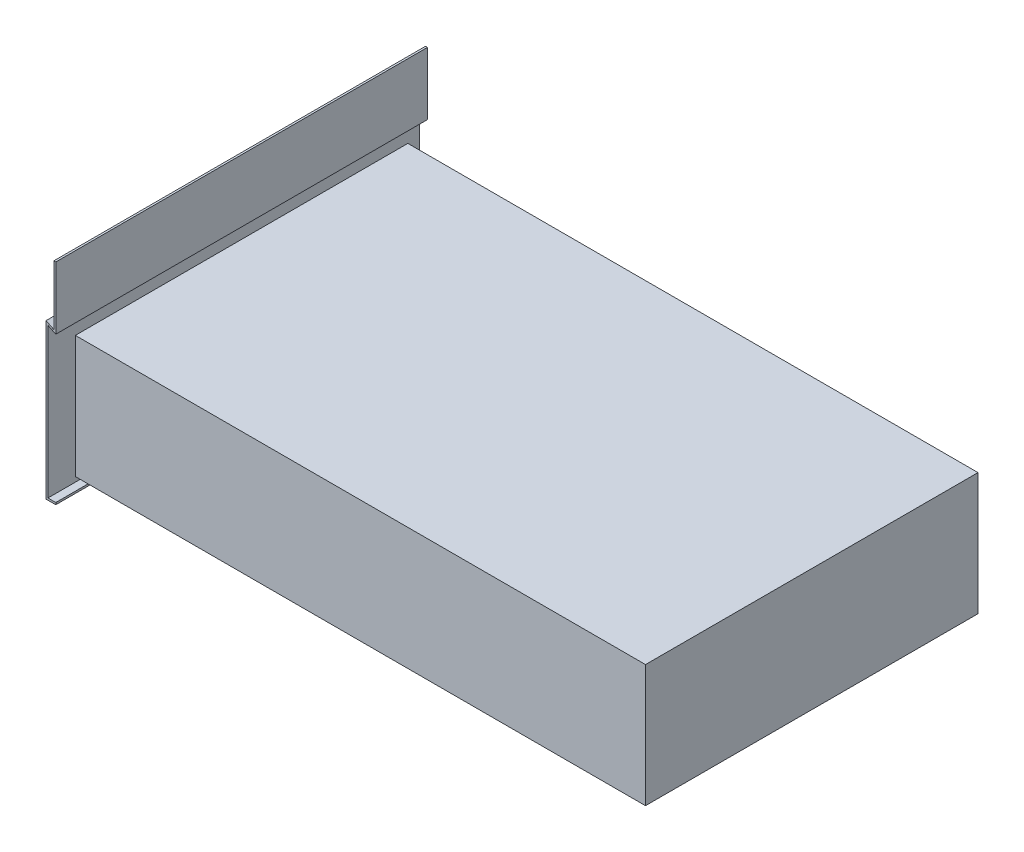
ISO-10303-21;
HEADER;
FILE_DESCRIPTION(('STEP AP214'),'2;1');
FILE_NAME('part.step','',(''),(''),'','','');
FILE_SCHEMA(('AUTOMOTIVE_DESIGN { 1 0 10303 214 1 1 1 1 }'));
ENDSEC;
DATA;
#1=APPLICATION_CONTEXT('core data for automotive mechanical design processes');
#2=APPLICATION_PROTOCOL_DEFINITION('international standard','automotive_design',2000,#1);
#3=PRODUCT_CONTEXT('',#1,'mechanical');
#4=PRODUCT('Part','Part','',(#3));
#5=PRODUCT_RELATED_PRODUCT_CATEGORY('part','',(#4));
#6=PRODUCT_DEFINITION_FORMATION('','',#4);
#7=PRODUCT_DEFINITION_CONTEXT('part definition',#1,'design');
#8=PRODUCT_DEFINITION('design','',#6,#7);
#9=PRODUCT_DEFINITION_SHAPE('','',#8);
#10=(LENGTH_UNIT() NAMED_UNIT(*) SI_UNIT(.MILLI.,.METRE.));
#11=(NAMED_UNIT(*) PLANE_ANGLE_UNIT() SI_UNIT($,.RADIAN.));
#12=(NAMED_UNIT(*) SI_UNIT($,.STERADIAN.) SOLID_ANGLE_UNIT());
#13=UNCERTAINTY_MEASURE_WITH_UNIT(LENGTH_MEASURE(1.E-05),#10,'distance_accuracy_value','');
#14=(GEOMETRIC_REPRESENTATION_CONTEXT(3) GLOBAL_UNCERTAINTY_ASSIGNED_CONTEXT((#13)) GLOBAL_UNIT_ASSIGNED_CONTEXT((#10,
#11,#12)) REPRESENTATION_CONTEXT('',''));
#15=CARTESIAN_POINT('',(0.,0.,0.));
#16=DIRECTION('',(0.,0.,1.));
#17=DIRECTION('',(1.,0.,0.));
#18=AXIS2_PLACEMENT_3D('',#15,#16,#17);
#19=CARTESIAN_POINT('',(0.,139.221174377272,-190.));
#20=DIRECTION('',(1.,0.,0.));
#21=DIRECTION('',(0.,0.,-1.));
#22=AXIS2_PLACEMENT_3D('',#19,#20,#21);
#23=PLANE('',#22);
#24=DIRECTION('',(0.,0.,1.));
#25=VECTOR('',#24,1.);
#26=CARTESIAN_POINT('',(0.,200.,-190.));
#27=LINE('',#26,#25);
#28=CARTESIAN_POINT('',(0.,200.,-190.));
#29=VERTEX_POINT('',#28);
#30=CARTESIAN_POINT('',(0.,200.,190.));
#31=VERTEX_POINT('',#30);
#32=EDGE_CURVE('E47',#29,#31,#27,.T.);
#33=ORIENTED_EDGE('',*,*,#32,.T.);
#34=DIRECTION('',(0.,1.,0.));
#35=VECTOR('',#34,1.);
#36=CARTESIAN_POINT('',(0.,139.221174377272,190.));
#37=LINE('',#36,#35);
#38=CARTESIAN_POINT('',(0.,136.043424311535,190.));
#39=VERTEX_POINT('',#38);
#40=EDGE_CURVE('E120',#39,#31,#37,.T.);
#41=ORIENTED_EDGE('',*,*,#40,.F.);
#42=DIRECTION('',(0.,0.,1.));
#43=VECTOR('',#42,1.);
#44=CARTESIAN_POINT('',(0.,136.043424311535,-190.));
#45=LINE('',#44,#43);
#46=CARTESIAN_POINT('',(0.,136.043424311535,-190.));
#47=VERTEX_POINT('',#46);
#48=EDGE_CURVE('E12',#47,#39,#45,.T.);
#49=ORIENTED_EDGE('',*,*,#48,.F.);
#50=DIRECTION('',(0.,1.,0.));
#51=VECTOR('',#50,1.);
#52=CARTESIAN_POINT('',(0.,139.221174377272,-190.));
#53=LINE('',#52,#51);
#54=EDGE_CURVE('E121',#47,#29,#53,.T.);
#55=ORIENTED_EDGE('',*,*,#54,.T.);
#56=EDGE_LOOP('',(#33,#41,#49,#55));
#57=FACE_BOUND('',#56,.T.);
#58=ADVANCED_FACE('F44',(#57),#23,.T.);
#59=CARTESIAN_POINT('',(-10.8650949326902,141.25594771106,-190.));
#60=DIRECTION('',(-0.432547466345104,-0.901611163062232,0.));
#61=DIRECTION('',(0.901611163062232,-0.432547466345104,0.));
#62=AXIS2_PLACEMENT_3D('',#59,#60,#61);
#63=PLANE('',#62);
#64=ORIENTED_EDGE('',*,*,#48,.T.);
#65=DIRECTION('',(0.901611163062232,-0.432547466345104,0.));
#66=VECTOR('',#65,1.);
#67=CARTESIAN_POINT('',(-10.8650949326902,141.25594771106,190.));
#68=LINE('',#67,#66);
#69=CARTESIAN_POINT('',(-8.,139.881419971447,190.));
#70=VERTEX_POINT('',#69);
#71=EDGE_CURVE('E135',#70,#39,#68,.T.);
#72=ORIENTED_EDGE('',*,*,#71,.F.);
#73=DIRECTION('',(0.,0.,1.));
#74=VECTOR('',#73,1.);
#75=CARTESIAN_POINT('',(-8.,139.881419971447,-190.));
#76=LINE('',#75,#74);
#77=CARTESIAN_POINT('',(-8.,139.881419971447,-190.));
#78=VERTEX_POINT('',#77);
#79=EDGE_CURVE('E52',#78,#70,#76,.T.);
#80=ORIENTED_EDGE('',*,*,#79,.F.);
#81=DIRECTION('',(0.901611163062232,-0.432547466345104,0.));
#82=VECTOR('',#81,1.);
#83=CARTESIAN_POINT('',(-10.8650949326902,141.25594771106,-190.));
#84=LINE('',#83,#82);
#85=EDGE_CURVE('E126',#78,#47,#84,.T.);
#86=ORIENTED_EDGE('',*,*,#85,.T.);
#87=EDGE_LOOP('',(#64,#72,#80,#86));
#88=FACE_BOUND('',#87,.T.);
#89=ADVANCED_FACE('F225',(#88),#63,.T.);
#90=CARTESIAN_POINT('',(-8.,-15.,-190.));
#91=DIRECTION('',(1.,0.,0.));
#92=DIRECTION('',(0.,0.,-1.));
#93=AXIS2_PLACEMENT_3D('',#90,#91,#92);
#94=PLANE('',#93);
#95=ORIENTED_EDGE('',*,*,#79,.T.);
#96=DIRECTION('',(0.,1.,0.));
#97=VECTOR('',#96,1.);
#98=CARTESIAN_POINT('',(-8.,-15.,190.));
#99=LINE('',#98,#97);
#100=CARTESIAN_POINT('',(-8.,-13.,190.));
#101=VERTEX_POINT('',#100);
#102=EDGE_CURVE('E158',#101,#70,#99,.T.);
#103=ORIENTED_EDGE('',*,*,#102,.F.);
#104=DIRECTION('',(0.,0.,1.));
#105=VECTOR('',#104,1.);
#106=CARTESIAN_POINT('',(-8.,-13.,-190.));
#107=LINE('',#106,#105);
#108=CARTESIAN_POINT('',(-8.,-13.,-190.));
#109=VERTEX_POINT('',#108);
#110=EDGE_CURVE('E181',#109,#101,#107,.T.);
#111=ORIENTED_EDGE('',*,*,#110,.F.);
#112=DIRECTION('',(0.,1.,0.));
#113=VECTOR('',#112,1.);
#114=CARTESIAN_POINT('',(-8.,-15.,-190.));
#115=LINE('',#114,#113);
#116=EDGE_CURVE('E177',#109,#78,#115,.T.);
#117=ORIENTED_EDGE('',*,*,#116,.T.);
#118=EDGE_LOOP('',(#95,#103,#111,#117));
#119=FACE_BOUND('',#118,.T.);
#120=ADVANCED_FACE('F220',(#119),#94,.T.);
#121=CARTESIAN_POINT('',(0.,-13.,-190.));
#122=DIRECTION('',(0.,1.,0.));
#123=DIRECTION('',(-1.,0.,0.));
#124=AXIS2_PLACEMENT_3D('',#121,#122,#123);
#125=PLANE('',#124);
#126=ORIENTED_EDGE('',*,*,#110,.T.);
#127=DIRECTION('',(-1.,0.,0.));
#128=VECTOR('',#127,1.);
#129=CARTESIAN_POINT('',(0.,-13.,190.));
#130=LINE('',#129,#128);
#131=CARTESIAN_POINT('',(0.,-13.,190.));
#132=VERTEX_POINT('',#131);
#133=EDGE_CURVE('E155',#132,#101,#130,.T.);
#134=ORIENTED_EDGE('',*,*,#133,.F.);
#135=DIRECTION('',(0.,0.,1.));
#136=VECTOR('',#135,1.);
#137=CARTESIAN_POINT('',(0.,-13.,-190.));
#138=LINE('',#137,#136);
#139=CARTESIAN_POINT('',(0.,-13.,-190.));
#140=VERTEX_POINT('',#139);
#141=EDGE_CURVE('E183',#140,#132,#138,.T.);
#142=ORIENTED_EDGE('',*,*,#141,.F.);
#143=DIRECTION('',(-1.,0.,0.));
#144=VECTOR('',#143,1.);
#145=CARTESIAN_POINT('',(0.,-13.,-190.));
#146=LINE('',#145,#144);
#147=EDGE_CURVE('E174',#140,#109,#146,.T.);
#148=ORIENTED_EDGE('',*,*,#147,.T.);
#149=EDGE_LOOP('',(#126,#134,#142,#148));
#150=FACE_BOUND('',#149,.T.);
#151=ADVANCED_FACE('F232',(#150),#125,.T.);
#152=CARTESIAN_POINT('',(0.,-13.,-190.));
#153=DIRECTION('',(-1.,0.,0.));
#154=DIRECTION('',(0.,-1.,0.));
#155=AXIS2_PLACEMENT_3D('',#152,#153,#154);
#156=PLANE('',#155);
#157=ORIENTED_EDGE('',*,*,#141,.T.);
#158=DIRECTION('',(0.,-1.,0.));
#159=VECTOR('',#158,1.);
#160=CARTESIAN_POINT('',(0.,-13.,190.));
#161=LINE('',#160,#159);
#162=CARTESIAN_POINT('',(0.,-15.,190.));
#163=VERTEX_POINT('',#162);
#164=EDGE_CURVE('E152',#132,#163,#161,.T.);
#165=ORIENTED_EDGE('',*,*,#164,.T.);
#166=DIRECTION('',(0.,0.,1.));
#167=VECTOR('',#166,1.);
#168=CARTESIAN_POINT('',(0.,-15.,-190.));
#169=LINE('',#168,#167);
#170=CARTESIAN_POINT('',(0.,-15.,-190.));
#171=VERTEX_POINT('',#170);
#172=EDGE_CURVE('E185',#171,#163,#169,.T.);
#173=ORIENTED_EDGE('',*,*,#172,.F.);
#174=DIRECTION('',(0.,-1.,0.));
#175=VECTOR('',#174,1.);
#176=CARTESIAN_POINT('',(0.,-13.,-190.));
#177=LINE('',#176,#175);
#178=EDGE_CURVE('E172',#140,#171,#177,.T.);
#179=ORIENTED_EDGE('',*,*,#178,.F.);
#180=EDGE_LOOP('',(#157,#165,#173,#179));
#181=FACE_BOUND('',#180,.T.);
#182=ADVANCED_FACE('F214',(#181),#156,.F.);
#183=CARTESIAN_POINT('',(0.,-15.,-190.));
#184=DIRECTION('',(0.,1.,0.));
#185=DIRECTION('',(-1.,0.,0.));
#186=AXIS2_PLACEMENT_3D('',#183,#184,#185);
#187=PLANE('',#186);
#188=ORIENTED_EDGE('',*,*,#172,.T.);
#189=DIRECTION('',(-1.,0.,0.));
#190=VECTOR('',#189,1.);
#191=CARTESIAN_POINT('',(0.,-15.,190.));
#192=LINE('',#191,#190);
#193=CARTESIAN_POINT('',(-10.,-15.,190.));
#194=VERTEX_POINT('',#193);
#195=EDGE_CURVE('E149',#163,#194,#192,.T.);
#196=ORIENTED_EDGE('',*,*,#195,.T.);
#197=DIRECTION('',(0.,0.,1.));
#198=VECTOR('',#197,1.);
#199=CARTESIAN_POINT('',(-10.,-15.,-190.));
#200=LINE('',#199,#198);
#201=CARTESIAN_POINT('',(-10.,-15.,-190.));
#202=VERTEX_POINT('',#201);
#203=EDGE_CURVE('E187',#202,#194,#200,.T.);
#204=ORIENTED_EDGE('',*,*,#203,.F.);
#205=DIRECTION('',(-1.,0.,0.));
#206=VECTOR('',#205,1.);
#207=CARTESIAN_POINT('',(0.,-15.,-190.));
#208=LINE('',#207,#206);
#209=EDGE_CURVE('E170',#171,#202,#208,.T.);
#210=ORIENTED_EDGE('',*,*,#209,.F.);
#211=EDGE_LOOP('',(#188,#196,#204,#210));
#212=FACE_BOUND('',#211,.T.);
#213=ADVANCED_FACE('F209',(#212),#187,.F.);
#214=CARTESIAN_POINT('',(-10.,-15.,-190.));
#215=DIRECTION('',(1.,0.,0.));
#216=DIRECTION('',(0.,0.,-1.));
#217=AXIS2_PLACEMENT_3D('',#214,#215,#216);
#218=PLANE('',#217);
#219=ORIENTED_EDGE('',*,*,#203,.T.);
#220=DIRECTION('',(0.,1.,0.));
#221=VECTOR('',#220,1.);
#222=CARTESIAN_POINT('',(-10.,-15.,190.));
#223=LINE('',#222,#221);
#224=CARTESIAN_POINT('',(-10.,143.059170037184,190.));
#225=VERTEX_POINT('',#224);
#226=EDGE_CURVE('E146',#194,#225,#223,.T.);
#227=ORIENTED_EDGE('',*,*,#226,.T.);
#228=DIRECTION('',(0.,0.,1.));
#229=VECTOR('',#228,1.);
#230=CARTESIAN_POINT('',(-10.,143.059170037184,-190.));
#231=LINE('',#230,#229);
#232=CARTESIAN_POINT('',(-10.,143.059170037184,-190.));
#233=VERTEX_POINT('',#232);
#234=EDGE_CURVE('E189',#233,#225,#231,.T.);
#235=ORIENTED_EDGE('',*,*,#234,.F.);
#236=DIRECTION('',(0.,1.,0.));
#237=VECTOR('',#236,1.);
#238=CARTESIAN_POINT('',(-10.,-15.,-190.));
#239=LINE('',#238,#237);
#240=EDGE_CURVE('E168',#202,#233,#239,.T.);
#241=ORIENTED_EDGE('',*,*,#240,.F.);
#242=EDGE_LOOP('',(#219,#227,#235,#241));
#243=FACE_BOUND('',#242,.T.);
#244=ADVANCED_FACE('F204',(#243),#218,.F.);
#245=CARTESIAN_POINT('',(-10.,143.059170037184,-190.));
#246=DIRECTION('',(-0.432547466345104,-0.901611163062232,0.));
#247=DIRECTION('',(0.901611163062232,-0.432547466345104,0.));
#248=AXIS2_PLACEMENT_3D('',#245,#246,#247);
#249=PLANE('',#248);
#250=ORIENTED_EDGE('',*,*,#234,.T.);
#251=DIRECTION('',(0.901611163062232,-0.432547466345104,0.));
#252=VECTOR('',#251,1.);
#253=CARTESIAN_POINT('',(-10.,143.059170037184,190.));
#254=LINE('',#253,#252);
#255=CARTESIAN_POINT('',(-2.,139.221174377272,190.));
#256=VERTEX_POINT('',#255);
#257=EDGE_CURVE('E141',#225,#256,#254,.T.);
#258=ORIENTED_EDGE('',*,*,#257,.T.);
#259=DIRECTION('',(0.,0.,1.));
#260=VECTOR('',#259,1.);
#261=CARTESIAN_POINT('',(-2.,139.221174377272,-190.));
#262=LINE('',#261,#260);
#263=CARTESIAN_POINT('',(-2.,139.221174377272,-190.));
#264=VERTEX_POINT('',#263);
#265=EDGE_CURVE('E191',#264,#256,#262,.T.);
#266=ORIENTED_EDGE('',*,*,#265,.F.);
#267=DIRECTION('',(0.901611163062232,-0.432547466345104,0.));
#268=VECTOR('',#267,1.);
#269=CARTESIAN_POINT('',(-10.,143.059170037184,-190.));
#270=LINE('',#269,#268);
#271=EDGE_CURVE('E166',#233,#264,#270,.T.);
#272=ORIENTED_EDGE('',*,*,#271,.F.);
#273=EDGE_LOOP('',(#250,#258,#266,#272));
#274=FACE_BOUND('',#273,.T.);
#275=ADVANCED_FACE('F200',(#274),#249,.F.);
#276=CARTESIAN_POINT('',(-2.,139.221174377272,-190.));
#277=DIRECTION('',(1.,0.,0.));
#278=DIRECTION('',(0.,0.,-1.));
#279=AXIS2_PLACEMENT_3D('',#276,#277,#278);
#280=PLANE('',#279);
#281=ORIENTED_EDGE('',*,*,#265,.T.);
#282=DIRECTION('',(0.,1.,0.));
#283=VECTOR('',#282,1.);
#284=CARTESIAN_POINT('',(-2.,139.221174377272,190.));
#285=LINE('',#284,#283);
#286=CARTESIAN_POINT('',(-2.,200.,190.));
#287=VERTEX_POINT('',#286);
#288=EDGE_CURVE('E139',#256,#287,#285,.T.);
#289=ORIENTED_EDGE('',*,*,#288,.T.);
#290=DIRECTION('',(0.,0.,1.));
#291=VECTOR('',#290,1.);
#292=CARTESIAN_POINT('',(-2.,200.,-190.));
#293=LINE('',#292,#291);
#294=CARTESIAN_POINT('',(-2.,200.,-190.));
#295=VERTEX_POINT('',#294);
#296=EDGE_CURVE('E125',#295,#287,#293,.T.);
#297=ORIENTED_EDGE('',*,*,#296,.F.);
#298=DIRECTION('',(0.,1.,0.));
#299=VECTOR('',#298,1.);
#300=CARTESIAN_POINT('',(-2.,139.221174377272,-190.));
#301=LINE('',#300,#299);
#302=EDGE_CURVE('E164',#264,#295,#301,.T.);
#303=ORIENTED_EDGE('',*,*,#302,.F.);
#304=EDGE_LOOP('',(#281,#289,#297,#303));
#305=FACE_BOUND('',#304,.T.);
#306=ADVANCED_FACE('F195',(#305),#280,.F.);
#307=CARTESIAN_POINT('',(-2.,200.,-190.));
#308=DIRECTION('',(0.,-1.,0.));
#309=DIRECTION('',(0.,0.,-1.));
#310=AXIS2_PLACEMENT_3D('',#307,#308,#309);
#311=PLANE('',#310);
#312=ORIENTED_EDGE('',*,*,#296,.T.);
#313=DIRECTION('',(1.,0.,0.));
#314=VECTOR('',#313,1.);
#315=CARTESIAN_POINT('',(-2.,200.,190.));
#316=LINE('',#315,#314);
#317=EDGE_CURVE('E132',#287,#31,#316,.T.);
#318=ORIENTED_EDGE('',*,*,#317,.T.);
#319=ORIENTED_EDGE('',*,*,#32,.F.);
#320=DIRECTION('',(1.,0.,0.));
#321=VECTOR('',#320,1.);
#322=CARTESIAN_POINT('',(-2.,200.,-190.));
#323=LINE('',#322,#321);
#324=EDGE_CURVE('E162',#295,#29,#323,.T.);
#325=ORIENTED_EDGE('',*,*,#324,.F.);
#326=EDGE_LOOP('',(#312,#318,#319,#325));
#327=FACE_BOUND('',#326,.T.);
#328=ADVANCED_FACE('F137',(#327),#311,.F.);
#329=CARTESIAN_POINT('',(0.,0.,-190.));
#330=DIRECTION('',(0.,0.,-1.));
#331=DIRECTION('',(-1.,0.,0.));
#332=AXIS2_PLACEMENT_3D('',#329,#330,#331);
#333=PLANE('',#332);
#334=ORIENTED_EDGE('',*,*,#54,.F.);
#335=ORIENTED_EDGE('',*,*,#85,.F.);
#336=ORIENTED_EDGE('',*,*,#116,.F.);
#337=ORIENTED_EDGE('',*,*,#147,.F.);
#338=ORIENTED_EDGE('',*,*,#178,.T.);
#339=ORIENTED_EDGE('',*,*,#209,.T.);
#340=ORIENTED_EDGE('',*,*,#240,.T.);
#341=ORIENTED_EDGE('',*,*,#271,.T.);
#342=ORIENTED_EDGE('',*,*,#302,.T.);
#343=ORIENTED_EDGE('',*,*,#324,.T.);
#344=EDGE_LOOP('',(#334,#335,#336,#337,#338,#339,#340,#341,#342,#343));
#345=FACE_BOUND('',#344,.T.);
#346=ADVANCED_FACE('F224',(#345),#333,.T.);
#347=CARTESIAN_POINT('',(0.,0.,190.));
#348=DIRECTION('',(0.,0.,-1.));
#349=DIRECTION('',(-1.,0.,0.));
#350=AXIS2_PLACEMENT_3D('',#347,#348,#349);
#351=PLANE('',#350);
#352=ORIENTED_EDGE('',*,*,#40,.T.);
#353=ORIENTED_EDGE('',*,*,#317,.F.);
#354=ORIENTED_EDGE('',*,*,#288,.F.);
#355=ORIENTED_EDGE('',*,*,#257,.F.);
#356=ORIENTED_EDGE('',*,*,#226,.F.);
#357=ORIENTED_EDGE('',*,*,#195,.F.);
#358=ORIENTED_EDGE('',*,*,#164,.F.);
#359=ORIENTED_EDGE('',*,*,#133,.T.);
#360=ORIENTED_EDGE('',*,*,#102,.T.);
#361=ORIENTED_EDGE('',*,*,#71,.T.);
#362=EDGE_LOOP('',(#352,#353,#354,#355,#356,#357,#358,#359,#360,#361));
#363=FACE_BOUND('',#362,.T.);
#364=ADVANCED_FACE('F130',(#363),#351,.F.);
#365=CLOSED_SHELL('',(#58,#89,#120,#151,#182,#213,#244,#275,#306,#328,#346,#364));
#366=MANIFOLD_SOLID_BREP('B2',#365);
#367=CARTESIAN_POINT('',(0.,125.,170.));
#368=DIRECTION('',(1.,0.,0.));
#369=DIRECTION('',(0.,0.,-1.));
#370=AXIS2_PLACEMENT_3D('',#367,#368,#369);
#371=PLANE('',#370);
#372=DIRECTION('',(0.,0.,1.));
#373=VECTOR('',#372,1.);
#374=CARTESIAN_POINT('',(0.,0.,170.));
#375=LINE('',#374,#373);
#376=CARTESIAN_POINT('',(0.,0.,-170.));
#377=VERTEX_POINT('',#376);
#378=CARTESIAN_POINT('',(0.,0.,170.));
#379=VERTEX_POINT('',#378);
#380=EDGE_CURVE('E422',#377,#379,#375,.T.);
#381=ORIENTED_EDGE('',*,*,#380,.T.);
#382=DIRECTION('',(0.,-1.,0.));
#383=VECTOR('',#382,1.);
#384=CARTESIAN_POINT('',(0.,125.,170.));
#385=LINE('',#384,#383);
#386=CARTESIAN_POINT('',(0.,125.,170.));
#387=VERTEX_POINT('',#386);
#388=EDGE_CURVE('E42',#387,#379,#385,.T.);
#389=ORIENTED_EDGE('',*,*,#388,.F.);
#390=DIRECTION('',(0.,0.,1.));
#391=VECTOR('',#390,1.);
#392=CARTESIAN_POINT('',(0.,125.,170.));
#393=LINE('',#392,#391);
#394=CARTESIAN_POINT('',(0.,125.,-170.));
#395=VERTEX_POINT('',#394);
#396=EDGE_CURVE('E432',#395,#387,#393,.T.);
#397=ORIENTED_EDGE('',*,*,#396,.F.);
#398=DIRECTION('',(0.,-1.,0.));
#399=VECTOR('',#398,1.);
#400=CARTESIAN_POINT('',(0.,125.,-170.));
#401=LINE('',#400,#399);
#402=EDGE_CURVE('E437',#395,#377,#401,.T.);
#403=ORIENTED_EDGE('',*,*,#402,.T.);
#404=EDGE_LOOP('',(#381,#389,#397,#403));
#405=FACE_BOUND('',#404,.T.);
#406=ADVANCED_FACE('F324',(#405),#371,.F.);
#407=CARTESIAN_POINT('',(0.,125.,170.));
#408=DIRECTION('',(0.,0.,-1.));
#409=DIRECTION('',(-1.,0.,0.));
#410=AXIS2_PLACEMENT_3D('',#407,#408,#409);
#411=PLANE('',#410);
#412=DIRECTION('',(1.,0.,0.));
#413=VECTOR('',#412,1.);
#414=CARTESIAN_POINT('',(0.,0.,170.));
#415=LINE('',#414,#413);
#416=CARTESIAN_POINT('',(583.,0.,170.));
#417=VERTEX_POINT('',#416);
#418=EDGE_CURVE('E426',#379,#417,#415,.T.);
#419=ORIENTED_EDGE('',*,*,#418,.T.);
#420=DIRECTION('',(0.,-1.,0.));
#421=VECTOR('',#420,1.);
#422=CARTESIAN_POINT('',(583.,125.,170.));
#423=LINE('',#422,#421);
#424=CARTESIAN_POINT('',(583.,125.,170.));
#425=VERTEX_POINT('',#424);
#426=EDGE_CURVE('E332',#425,#417,#423,.T.);
#427=ORIENTED_EDGE('',*,*,#426,.F.);
#428=DIRECTION('',(1.,0.,0.));
#429=VECTOR('',#428,1.);
#430=CARTESIAN_POINT('',(0.,125.,170.));
#431=LINE('',#430,#429);
#432=EDGE_CURVE('E371',#387,#425,#431,.T.);
#433=ORIENTED_EDGE('',*,*,#432,.F.);
#434=ORIENTED_EDGE('',*,*,#388,.T.);
#435=EDGE_LOOP('',(#419,#427,#433,#434));
#436=FACE_BOUND('',#435,.T.);
#437=ADVANCED_FACE('F461',(#436),#411,.F.);
#438=CARTESIAN_POINT('',(583.,125.,170.));
#439=DIRECTION('',(-1.,0.,0.));
#440=DIRECTION('',(0.,0.,1.));
#441=AXIS2_PLACEMENT_3D('',#438,#439,#440);
#442=PLANE('',#441);
#443=DIRECTION('',(0.,0.,-1.));
#444=VECTOR('',#443,1.);
#445=CARTESIAN_POINT('',(583.,0.,170.));
#446=LINE('',#445,#444);
#447=CARTESIAN_POINT('',(583.,0.,-170.));
#448=VERTEX_POINT('',#447);
#449=EDGE_CURVE('E358',#417,#448,#446,.T.);
#450=ORIENTED_EDGE('',*,*,#449,.T.);
#451=DIRECTION('',(0.,-1.,0.));
#452=VECTOR('',#451,1.);
#453=CARTESIAN_POINT('',(583.,125.,-170.));
#454=LINE('',#453,#452);
#455=CARTESIAN_POINT('',(583.,125.,-170.));
#456=VERTEX_POINT('',#455);
#457=EDGE_CURVE('E443',#456,#448,#454,.T.);
#458=ORIENTED_EDGE('',*,*,#457,.F.);
#459=DIRECTION('',(0.,0.,-1.));
#460=VECTOR('',#459,1.);
#461=CARTESIAN_POINT('',(583.,125.,170.));
#462=LINE('',#461,#460);
#463=EDGE_CURVE('E435',#425,#456,#462,.T.);
#464=ORIENTED_EDGE('',*,*,#463,.F.);
#465=ORIENTED_EDGE('',*,*,#426,.T.);
#466=EDGE_LOOP('',(#450,#458,#464,#465));
#467=FACE_BOUND('',#466,.T.);
#468=ADVANCED_FACE('F445',(#467),#442,.F.);
#469=CARTESIAN_POINT('',(0.,125.,-170.));
#470=DIRECTION('',(0.,0.,1.));
#471=DIRECTION('',(1.,0.,0.));
#472=AXIS2_PLACEMENT_3D('',#469,#470,#471);
#473=PLANE('',#472);
#474=DIRECTION('',(-1.,0.,0.));
#475=VECTOR('',#474,1.);
#476=CARTESIAN_POINT('',(0.,0.,-170.));
#477=LINE('',#476,#475);
#478=EDGE_CURVE('E364',#448,#377,#477,.T.);
#479=ORIENTED_EDGE('',*,*,#478,.T.);
#480=ORIENTED_EDGE('',*,*,#402,.F.);
#481=DIRECTION('',(-1.,0.,0.));
#482=VECTOR('',#481,1.);
#483=CARTESIAN_POINT('',(0.,125.,-170.));
#484=LINE('',#483,#482);
#485=EDGE_CURVE('E340',#456,#395,#484,.T.);
#486=ORIENTED_EDGE('',*,*,#485,.F.);
#487=ORIENTED_EDGE('',*,*,#457,.T.);
#488=EDGE_LOOP('',(#479,#480,#486,#487));
#489=FACE_BOUND('',#488,.T.);
#490=ADVANCED_FACE('F452',(#489),#473,.F.);
#491=CARTESIAN_POINT('',(0.,125.,0.));
#492=DIRECTION('',(0.,1.,0.));
#493=DIRECTION('',(0.,0.,1.));
#494=AXIS2_PLACEMENT_3D('',#491,#492,#493);
#495=PLANE('',#494);
#496=ORIENTED_EDGE('',*,*,#396,.T.);
#497=ORIENTED_EDGE('',*,*,#432,.T.);
#498=ORIENTED_EDGE('',*,*,#463,.T.);
#499=ORIENTED_EDGE('',*,*,#485,.T.);
#500=EDGE_LOOP('',(#496,#497,#498,#499));
#501=FACE_BOUND('',#500,.T.);
#502=ADVANCED_FACE('F454',(#501),#495,.T.);
#503=CARTESIAN_POINT('',(0.,0.,0.));
#504=DIRECTION('',(0.,1.,0.));
#505=DIRECTION('',(0.,0.,1.));
#506=AXIS2_PLACEMENT_3D('',#503,#504,#505);
#507=PLANE('',#506);
#508=ORIENTED_EDGE('',*,*,#380,.F.);
#509=ORIENTED_EDGE('',*,*,#478,.F.);
#510=ORIENTED_EDGE('',*,*,#449,.F.);
#511=ORIENTED_EDGE('',*,*,#418,.F.);
#512=EDGE_LOOP('',(#508,#509,#510,#511));
#513=FACE_BOUND('',#512,.T.);
#514=ADVANCED_FACE('F448',(#513),#507,.F.);
#515=CLOSED_SHELL('',(#406,#437,#468,#490,#502,#514));
#516=CARTESIAN_POINT('',(1.5,123.5,0.));
#517=DIRECTION('',(1.,0.,0.));
#518=DIRECTION('',(0.,0.,-1.));
#519=AXIS2_PLACEMENT_3D('',#516,#517,#518);
#520=PLANE('',#519);
#521=DIRECTION('',(0.,0.,1.));
#522=VECTOR('',#521,1.);
#523=CARTESIAN_POINT('',(1.5,1.5,0.));
#524=LINE('',#523,#522);
#525=CARTESIAN_POINT('',(1.5,1.5,-168.5));
#526=VERTEX_POINT('',#525);
#527=CARTESIAN_POINT('',(1.5,1.5,168.5));
#528=VERTEX_POINT('',#527);
#529=EDGE_CURVE('E551',#526,#528,#524,.T.);
#530=ORIENTED_EDGE('',*,*,#529,.F.);
#531=DIRECTION('',(0.,-1.,0.));
#532=VECTOR('',#531,1.);
#533=CARTESIAN_POINT('',(1.5,123.5,-168.5));
#534=LINE('',#533,#532);
#535=CARTESIAN_POINT('',(1.5,123.5,-168.5));
#536=VERTEX_POINT('',#535);
#537=EDGE_CURVE('E417',#536,#526,#534,.T.);
#538=ORIENTED_EDGE('',*,*,#537,.F.);
#539=DIRECTION('',(0.,0.,1.));
#540=VECTOR('',#539,1.);
#541=CARTESIAN_POINT('',(1.5,123.5,0.));
#542=LINE('',#541,#540);
#543=CARTESIAN_POINT('',(1.5,123.5,168.5));
#544=VERTEX_POINT('',#543);
#545=EDGE_CURVE('E402',#536,#544,#542,.T.);
#546=ORIENTED_EDGE('',*,*,#545,.T.);
#547=DIRECTION('',(0.,-1.,0.));
#548=VECTOR('',#547,1.);
#549=CARTESIAN_POINT('',(1.5,123.5,168.5));
#550=LINE('',#549,#548);
#551=EDGE_CURVE('E414',#544,#528,#550,.T.);
#552=ORIENTED_EDGE('',*,*,#551,.T.);
#553=EDGE_LOOP('',(#530,#538,#546,#552));
#554=FACE_BOUND('',#553,.T.);
#555=ADVANCED_FACE('F413',(#554),#520,.T.);
#556=CARTESIAN_POINT('',(0.,123.5,168.5));
#557=DIRECTION('',(0.,0.,-1.));
#558=DIRECTION('',(-1.,0.,0.));
#559=AXIS2_PLACEMENT_3D('',#556,#557,#558);
#560=PLANE('',#559);
#561=DIRECTION('',(1.,0.,0.));
#562=VECTOR('',#561,1.);
#563=CARTESIAN_POINT('',(0.,1.5,168.5));
#564=LINE('',#563,#562);
#565=CARTESIAN_POINT('',(581.5,1.5,168.5));
#566=VERTEX_POINT('',#565);
#567=EDGE_CURVE('E421',#528,#566,#564,.T.);
#568=ORIENTED_EDGE('',*,*,#567,.F.);
#569=ORIENTED_EDGE('',*,*,#551,.F.);
#570=DIRECTION('',(1.,0.,0.));
#571=VECTOR('',#570,1.);
#572=CARTESIAN_POINT('',(0.,123.5,168.5));
#573=LINE('',#572,#571);
#574=CARTESIAN_POINT('',(581.5,123.5,168.5));
#575=VERTEX_POINT('',#574);
#576=EDGE_CURVE('E398',#544,#575,#573,.T.);
#577=ORIENTED_EDGE('',*,*,#576,.T.);
#578=DIRECTION('',(0.,-1.,0.));
#579=VECTOR('',#578,1.);
#580=CARTESIAN_POINT('',(581.5,123.5,168.5));
#581=LINE('',#580,#579);
#582=EDGE_CURVE('E423',#575,#566,#581,.T.);
#583=ORIENTED_EDGE('',*,*,#582,.T.);
#584=EDGE_LOOP('',(#568,#569,#577,#583));
#585=FACE_BOUND('',#584,.T.);
#586=ADVANCED_FACE('F420',(#585),#560,.T.);
#587=CARTESIAN_POINT('',(581.5,123.5,0.));
#588=DIRECTION('',(-1.,0.,0.));
#589=DIRECTION('',(0.,0.,1.));
#590=AXIS2_PLACEMENT_3D('',#587,#588,#589);
#591=PLANE('',#590);
#592=DIRECTION('',(0.,0.,-1.));
#593=VECTOR('',#592,1.);
#594=CARTESIAN_POINT('',(581.5,1.5,0.));
#595=LINE('',#594,#593);
#596=CARTESIAN_POINT('',(581.5,1.5,-168.5));
#597=VERTEX_POINT('',#596);
#598=EDGE_CURVE('E554',#566,#597,#595,.T.);
#599=ORIENTED_EDGE('',*,*,#598,.F.);
#600=ORIENTED_EDGE('',*,*,#582,.F.);
#601=DIRECTION('',(0.,0.,-1.));
#602=VECTOR('',#601,1.);
#603=CARTESIAN_POINT('',(581.5,123.5,0.));
#604=LINE('',#603,#602);
#605=CARTESIAN_POINT('',(581.5,123.5,-168.5));
#606=VERTEX_POINT('',#605);
#607=EDGE_CURVE('E403',#575,#606,#604,.T.);
#608=ORIENTED_EDGE('',*,*,#607,.T.);
#609=DIRECTION('',(0.,-1.,0.));
#610=VECTOR('',#609,1.);
#611=CARTESIAN_POINT('',(581.5,123.5,-168.5));
#612=LINE('',#611,#610);
#613=EDGE_CURVE('E428',#606,#597,#612,.T.);
#614=ORIENTED_EDGE('',*,*,#613,.T.);
#615=EDGE_LOOP('',(#599,#600,#608,#614));
#616=FACE_BOUND('',#615,.T.);
#617=ADVANCED_FACE('F509',(#616),#591,.T.);
#618=CARTESIAN_POINT('',(0.,123.5,-168.5));
#619=DIRECTION('',(0.,0.,1.));
#620=DIRECTION('',(1.,0.,0.));
#621=AXIS2_PLACEMENT_3D('',#618,#619,#620);
#622=PLANE('',#621);
#623=DIRECTION('',(-1.,0.,0.));
#624=VECTOR('',#623,1.);
#625=CARTESIAN_POINT('',(0.,1.5,-168.5));
#626=LINE('',#625,#624);
#627=EDGE_CURVE('E418',#597,#526,#626,.T.);
#628=ORIENTED_EDGE('',*,*,#627,.F.);
#629=ORIENTED_EDGE('',*,*,#613,.F.);
#630=DIRECTION('',(-1.,0.,0.));
#631=VECTOR('',#630,1.);
#632=CARTESIAN_POINT('',(0.,123.5,-168.5));
#633=LINE('',#632,#631);
#634=EDGE_CURVE('E557',#606,#536,#633,.T.);
#635=ORIENTED_EDGE('',*,*,#634,.T.);
#636=ORIENTED_EDGE('',*,*,#537,.T.);
#637=EDGE_LOOP('',(#628,#629,#635,#636));
#638=FACE_BOUND('',#637,.T.);
#639=ADVANCED_FACE('F518',(#638),#622,.T.);
#640=CARTESIAN_POINT('',(0.,123.5,0.));
#641=DIRECTION('',(0.,1.,0.));
#642=DIRECTION('',(0.,0.,1.));
#643=AXIS2_PLACEMENT_3D('',#640,#641,#642);
#644=PLANE('',#643);
#645=ORIENTED_EDGE('',*,*,#545,.F.);
#646=ORIENTED_EDGE('',*,*,#634,.F.);
#647=ORIENTED_EDGE('',*,*,#607,.F.);
#648=ORIENTED_EDGE('',*,*,#576,.F.);
#649=EDGE_LOOP('',(#645,#646,#647,#648));
#650=FACE_BOUND('',#649,.T.);
#651=ADVANCED_FACE('F400',(#650),#644,.F.);
#652=CARTESIAN_POINT('',(0.,1.5,0.));
#653=DIRECTION('',(0.,1.,0.));
#654=DIRECTION('',(0.,0.,1.));
#655=AXIS2_PLACEMENT_3D('',#652,#653,#654);
#656=PLANE('',#655);
#657=ORIENTED_EDGE('',*,*,#529,.T.);
#658=ORIENTED_EDGE('',*,*,#567,.T.);
#659=ORIENTED_EDGE('',*,*,#598,.T.);
#660=ORIENTED_EDGE('',*,*,#627,.T.);
#661=EDGE_LOOP('',(#657,#658,#659,#660));
#662=FACE_BOUND('',#661,.T.);
#663=ADVANCED_FACE('F537',(#662),#656,.T.);
#664=CLOSED_SHELL('',(#555,#586,#617,#639,#651,#663));
#665=ORIENTED_CLOSED_SHELL('',*,#664,.T.);
#666=BREP_WITH_VOIDS('B6',#515,(#665));
#667=ADVANCED_BREP_SHAPE_REPRESENTATION('',(#18,#366,#666),#14);
#668=SHAPE_DEFINITION_REPRESENTATION(#9,#667);
ENDSEC;
END-ISO-10303-21;
